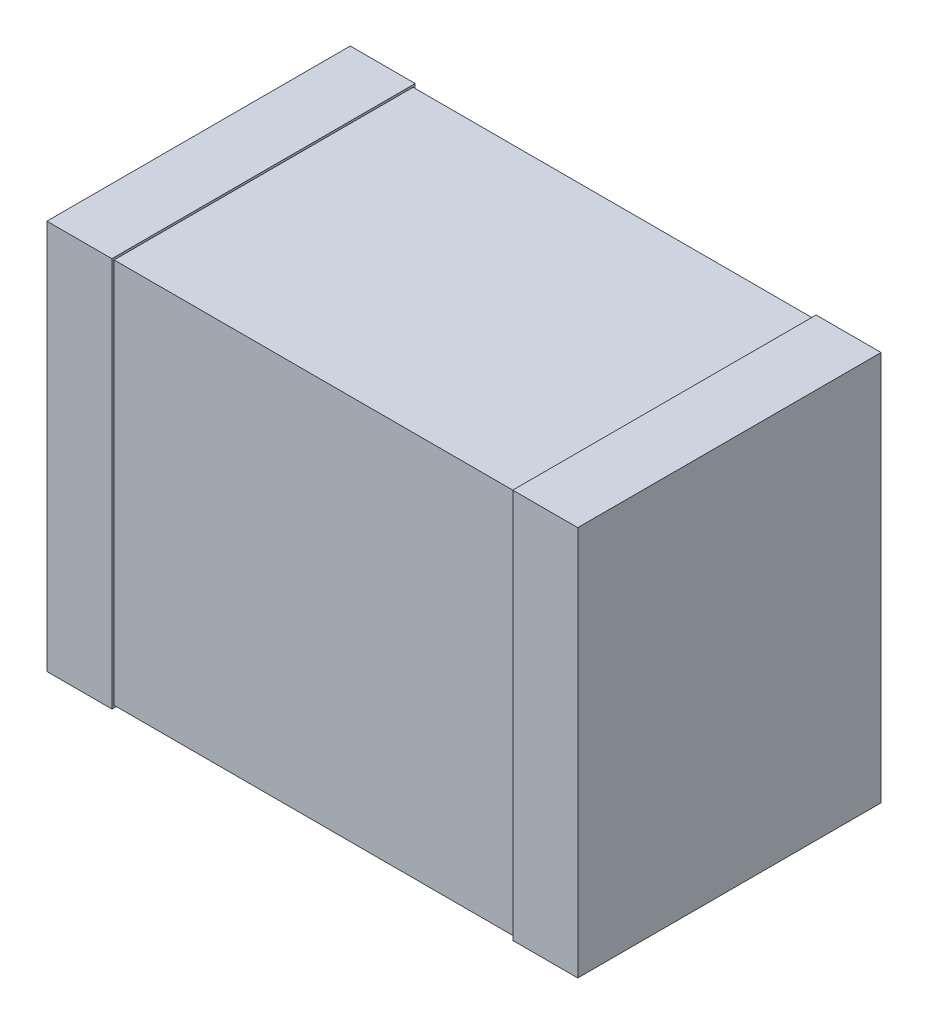
ISO-10303-21;
HEADER;
FILE_DESCRIPTION(('STEP AP214'),'2;1');
FILE_NAME('part.step','',(''),(''),'','','');
FILE_SCHEMA(('AUTOMOTIVE_DESIGN { 1 0 10303 214 1 1 1 1 }'));
ENDSEC;
DATA;
#1=APPLICATION_CONTEXT('core data for automotive mechanical design processes');
#2=APPLICATION_PROTOCOL_DEFINITION('international standard','automotive_design',2000,#1);
#3=PRODUCT_CONTEXT('',#1,'mechanical');
#4=PRODUCT('Part','Part','',(#3));
#5=PRODUCT_RELATED_PRODUCT_CATEGORY('part','',(#4));
#6=PRODUCT_DEFINITION_FORMATION('','',#4);
#7=PRODUCT_DEFINITION_CONTEXT('part definition',#1,'design');
#8=PRODUCT_DEFINITION('design','',#6,#7);
#9=PRODUCT_DEFINITION_SHAPE('','',#8);
#10=(LENGTH_UNIT() NAMED_UNIT(*) SI_UNIT(.MILLI.,.METRE.));
#11=(NAMED_UNIT(*) PLANE_ANGLE_UNIT() SI_UNIT($,.RADIAN.));
#12=(NAMED_UNIT(*) SI_UNIT($,.STERADIAN.) SOLID_ANGLE_UNIT());
#13=UNCERTAINTY_MEASURE_WITH_UNIT(LENGTH_MEASURE(1.E-05),#10,'distance_accuracy_value','');
#14=(GEOMETRIC_REPRESENTATION_CONTEXT(3) GLOBAL_UNCERTAINTY_ASSIGNED_CONTEXT((#13)) GLOBAL_UNIT_ASSIGNED_CONTEXT((#10,
#11,#12)) REPRESENTATION_CONTEXT('',''));
#15=CARTESIAN_POINT('',(0.,0.,0.));
#16=DIRECTION('',(0.,0.,1.));
#17=DIRECTION('',(1.,0.,0.));
#18=AXIS2_PLACEMENT_3D('',#15,#16,#17);
#19=CARTESIAN_POINT('',(-2.449999999897,1.8,291599.7089351));
#20=DIRECTION('',(-1.,0.,0.));
#21=DIRECTION('',(0.,0.,1.));
#22=AXIS2_PLACEMENT_3D('',#19,#20,#21);
#23=PLANE('',#22);
#24=DIRECTION('',(0.,0.,-1.));
#25=VECTOR('',#24,1.);
#26=CARTESIAN_POINT('',(-2.45000000001,1.8,1.081397970488E-11));
#27=LINE('',#26,#25);
#28=CARTESIAN_POINT('',(-2.4500000000044,1.8,2.79999999997907));
#29=VERTEX_POINT('',#28);
#30=CARTESIAN_POINT('',(-2.45000000000447,1.8,8.11048477869001E-12));
#31=VERTEX_POINT('',#30);
#32=EDGE_CURVE('E116',#29,#31,#27,.T.);
#33=ORIENTED_EDGE('',*,*,#32,.T.);
#34=DIRECTION('',(0.,1.,0.));
#35=VECTOR('',#34,1.);
#36=CARTESIAN_POINT('',(-2.45000000001028,1.8,1.081397970494E-11));
#37=LINE('',#36,#35);
#38=CARTESIAN_POINT('',(-2.4500000000044,-1.8,8.110484778675E-12));
#39=VERTEX_POINT('',#38);
#40=EDGE_CURVE('E103',#39,#31,#37,.T.);
#41=ORIENTED_EDGE('',*,*,#40,.F.);
#42=DIRECTION('',(0.,0.,-1.));
#43=VECTOR('',#42,1.);
#44=CARTESIAN_POINT('',(-2.45000000001,-1.8,1.081397970488E-11));
#45=LINE('',#44,#43);
#46=CARTESIAN_POINT('',(-2.4500000000044,-1.8,2.79999999997907));
#47=VERTEX_POINT('',#46);
#48=EDGE_CURVE('E20',#47,#39,#45,.T.);
#49=ORIENTED_EDGE('',*,*,#48,.F.);
#50=DIRECTION('',(0.,1.,0.));
#51=VECTOR('',#50,1.);
#52=CARTESIAN_POINT('',(-2.45000000001028,1.8,2.799999999979));
#53=LINE('',#52,#51);
#54=EDGE_CURVE('E131',#29,#47,#53,.F.);
#55=ORIENTED_EDGE('',*,*,#54,.F.);
#56=EDGE_LOOP('',(#33,#41,#49,#55));
#57=FACE_BOUND('',#56,.T.);
#58=ADVANCED_FACE('F17',(#57),#23,.T.);
#59=CARTESIAN_POINT('',(2.45000000001,1.8,291599.7089351));
#60=DIRECTION('',(1.,0.,0.));
#61=DIRECTION('',(0.,0.,-1.));
#62=AXIS2_PLACEMENT_3D('',#59,#60,#61);
#63=PLANE('',#62);
#64=DIRECTION('',(0.,0.,-1.));
#65=VECTOR('',#64,1.);
#66=CARTESIAN_POINT('',(2.45000000001,1.8,2.799999999979));
#67=LINE('',#66,#65);
#68=CARTESIAN_POINT('',(2.45000000001007,1.8,3.6787792864193E-12));
#69=VERTEX_POINT('',#68);
#70=CARTESIAN_POINT('',(2.45000000001014,1.8,2.79999999997907));
#71=VERTEX_POINT('',#70);
#72=EDGE_CURVE('E142',#69,#71,#67,.F.);
#73=ORIENTED_EDGE('',*,*,#72,.T.);
#74=DIRECTION('',(0.,1.,0.));
#75=VECTOR('',#74,1.);
#76=CARTESIAN_POINT('',(2.45000000001028,1.8,2.799999999979));
#77=LINE('',#76,#75);
#78=CARTESIAN_POINT('',(2.45000000001007,-1.8,2.79999999997907));
#79=VERTEX_POINT('',#78);
#80=EDGE_CURVE('E138',#79,#71,#77,.T.);
#81=ORIENTED_EDGE('',*,*,#80,.F.);
#82=DIRECTION('',(0.,0.,-1.));
#83=VECTOR('',#82,1.);
#84=CARTESIAN_POINT('',(2.45000000001,-1.8,2.799999999979));
#85=LINE('',#84,#83);
#86=CARTESIAN_POINT('',(2.45000000001007,-1.8,3.6787792864193E-12));
#87=VERTEX_POINT('',#86);
#88=EDGE_CURVE('E133',#87,#79,#85,.F.);
#89=ORIENTED_EDGE('',*,*,#88,.F.);
#90=DIRECTION('',(0.,1.,0.));
#91=VECTOR('',#90,1.);
#92=CARTESIAN_POINT('',(2.45000000001028,1.8,4.90525588902837E-12));
#93=LINE('',#92,#91);
#94=EDGE_CURVE('E151',#69,#87,#93,.F.);
#95=ORIENTED_EDGE('',*,*,#94,.F.);
#96=EDGE_LOOP('',(#73,#81,#89,#95));
#97=FACE_BOUND('',#96,.T.);
#98=ADVANCED_FACE('F272',(#97),#63,.T.);
#99=CARTESIAN_POINT('',(-2.45000000001,-1.8,1.081397970488E-11));
#100=DIRECTION('',(0.,-1.,0.));
#101=DIRECTION('',(0.,0.,-1.));
#102=AXIS2_PLACEMENT_3D('',#99,#100,#101);
#103=PLANE('',#102);
#104=DIRECTION('',(0.,0.,-1.));
#105=VECTOR('',#104,1.);
#106=CARTESIAN_POINT('',(-1.849999999877,-1.8,291599.7089351));
#107=LINE('',#106,#105);
#108=CARTESIAN_POINT('',(-1.84999999997292,-1.8,2.79999999997907));
#109=VERTEX_POINT('',#108);
#110=CARTESIAN_POINT('',(-1.84999999997292,-1.8,8.11033961905378E-12));
#111=VERTEX_POINT('',#110);
#112=EDGE_CURVE('E154',#109,#111,#107,.T.);
#113=ORIENTED_EDGE('',*,*,#112,.F.);
#114=DIRECTION('',(1.,0.,0.));
#115=VECTOR('',#114,1.);
#116=CARTESIAN_POINT('',(-400000.,-1.8,2.799999999979));
#117=LINE('',#116,#115);
#118=EDGE_CURVE('E112',#47,#109,#117,.T.);
#119=ORIENTED_EDGE('',*,*,#118,.F.);
#120=ORIENTED_EDGE('',*,*,#48,.T.);
#121=DIRECTION('',(-1.,0.,0.));
#122=VECTOR('',#121,1.);
#123=CARTESIAN_POINT('',(-400000.,-1.8,3.979039320257E-10));
#124=LINE('',#123,#122);
#125=EDGE_CURVE('E109',#111,#39,#124,.T.);
#126=ORIENTED_EDGE('',*,*,#125,.F.);
#127=EDGE_LOOP('',(#113,#119,#120,#126));
#128=FACE_BOUND('',#127,.T.);
#129=ADVANCED_FACE('F108',(#128),#103,.T.);
#130=CARTESIAN_POINT('',(-400000.,1.8,3.979039320257E-10));
#131=DIRECTION('',(0.,0.,-1.));
#132=DIRECTION('',(-1.,0.,0.));
#133=AXIS2_PLACEMENT_3D('',#130,#131,#132);
#134=PLANE('',#133);
#135=DIRECTION('',(1.,0.,0.));
#136=VECTOR('',#135,1.);
#137=CARTESIAN_POINT('',(-2.45000000001,1.8,1.081397970488E-11));
#138=LINE('',#137,#136);
#139=CARTESIAN_POINT('',(-1.84999999997876,1.8,8.11019445944756E-12));
#140=VERTEX_POINT('',#139);
#141=EDGE_CURVE('E118',#31,#140,#138,.T.);
#142=ORIENTED_EDGE('',*,*,#141,.T.);
#143=DIRECTION('',(0.,1.,0.));
#144=VECTOR('',#143,1.);
#145=CARTESIAN_POINT('',(-1.84999999996733,1.8,0.));
#146=LINE('',#145,#144);
#147=EDGE_CURVE('E122',#111,#140,#146,.T.);
#148=ORIENTED_EDGE('',*,*,#147,.F.);
#149=ORIENTED_EDGE('',*,*,#125,.T.);
#150=ORIENTED_EDGE('',*,*,#40,.T.);
#151=EDGE_LOOP('',(#142,#148,#149,#150));
#152=FACE_BOUND('',#151,.T.);
#153=ADVANCED_FACE('F120',(#152),#134,.T.);
#154=CARTESIAN_POINT('',(-2.45000000001,1.8,1.081397970488E-11));
#155=DIRECTION('',(0.,-1.,0.));
#156=DIRECTION('',(0.,0.,-1.));
#157=AXIS2_PLACEMENT_3D('',#154,#155,#156);
#158=PLANE('',#157);
#159=DIRECTION('',(1.,0.,0.));
#160=VECTOR('',#159,1.);
#161=CARTESIAN_POINT('',(-400000.,1.8,2.799999999979));
#162=LINE('',#161,#160);
#163=CARTESIAN_POINT('',(-1.84999999997292,1.8,2.79999999997907));
#164=VERTEX_POINT('',#163);
#165=EDGE_CURVE('E128',#164,#29,#162,.F.);
#166=ORIENTED_EDGE('',*,*,#165,.F.);
#167=DIRECTION('',(0.,0.,-1.));
#168=VECTOR('',#167,1.);
#169=CARTESIAN_POINT('',(-1.849999999877,1.8,291599.7089351));
#170=LINE('',#169,#168);
#171=EDGE_CURVE('E157',#140,#164,#170,.F.);
#172=ORIENTED_EDGE('',*,*,#171,.F.);
#173=ORIENTED_EDGE('',*,*,#141,.F.);
#174=ORIENTED_EDGE('',*,*,#32,.F.);
#175=EDGE_LOOP('',(#166,#172,#173,#174));
#176=FACE_BOUND('',#175,.T.);
#177=ADVANCED_FACE('F224',(#176),#158,.F.);
#178=CARTESIAN_POINT('',(-400000.,1.8,2.799999999979));
#179=DIRECTION('',(0.,0.,1.));
#180=DIRECTION('',(1.,0.,0.));
#181=AXIS2_PLACEMENT_3D('',#178,#179,#180);
#182=PLANE('',#181);
#183=ORIENTED_EDGE('',*,*,#165,.T.);
#184=ORIENTED_EDGE('',*,*,#54,.T.);
#185=ORIENTED_EDGE('',*,*,#118,.T.);
#186=DIRECTION('',(0.,1.,0.));
#187=VECTOR('',#186,1.);
#188=CARTESIAN_POINT('',(-1.84999999996733,1.8,2.79999999997926));
#189=LINE('',#188,#187);
#190=EDGE_CURVE('E160',#164,#109,#189,.F.);
#191=ORIENTED_EDGE('',*,*,#190,.F.);
#192=EDGE_LOOP('',(#183,#184,#185,#191));
#193=FACE_BOUND('',#192,.T.);
#194=ADVANCED_FACE('F226',(#193),#182,.T.);
#195=CARTESIAN_POINT('',(2.45000000001,-1.8,2.799999999979));
#196=DIRECTION('',(0.,-1.,0.));
#197=DIRECTION('',(0.,0.,-1.));
#198=AXIS2_PLACEMENT_3D('',#195,#196,#197);
#199=PLANE('',#198);
#200=DIRECTION('',(0.,0.,1.));
#201=VECTOR('',#200,1.);
#202=CARTESIAN_POINT('',(1.84999999999,-1.8,291599.7089351));
#203=LINE('',#202,#201);
#204=CARTESIAN_POINT('',(1.84999999999009,-1.8,3.67867086620206E-12));
#205=VERTEX_POINT('',#204);
#206=CARTESIAN_POINT('',(1.84999999999009,-1.8,2.79999999997907));
#207=VERTEX_POINT('',#206);
#208=EDGE_CURVE('E170',#205,#207,#203,.T.);
#209=ORIENTED_EDGE('',*,*,#208,.F.);
#210=DIRECTION('',(-1.,0.,0.));
#211=VECTOR('',#210,1.);
#212=CARTESIAN_POINT('',(-400000.,-1.8,-2.84217094304E-10));
#213=LINE('',#212,#211);
#214=EDGE_CURVE('E145',#87,#205,#213,.T.);
#215=ORIENTED_EDGE('',*,*,#214,.F.);
#216=ORIENTED_EDGE('',*,*,#88,.T.);
#217=DIRECTION('',(1.,0.,0.));
#218=VECTOR('',#217,1.);
#219=CARTESIAN_POINT('',(-400000.,-1.8,2.799999999979));
#220=LINE('',#219,#218);
#221=EDGE_CURVE('E135',#207,#79,#220,.T.);
#222=ORIENTED_EDGE('',*,*,#221,.F.);
#223=EDGE_LOOP('',(#209,#215,#216,#222));
#224=FACE_BOUND('',#223,.T.);
#225=ADVANCED_FACE('F228',(#224),#199,.T.);
#226=CARTESIAN_POINT('',(-400000.,1.8,2.799999999979));
#227=DIRECTION('',(0.,0.,1.));
#228=DIRECTION('',(1.,0.,0.));
#229=AXIS2_PLACEMENT_3D('',#226,#227,#228);
#230=PLANE('',#229);
#231=DIRECTION('',(1.,0.,0.));
#232=VECTOR('',#231,1.);
#233=CARTESIAN_POINT('',(2.45000000001,1.8,2.799999999979));
#234=LINE('',#233,#232);
#235=CARTESIAN_POINT('',(1.84999999999018,1.8,2.79999999997907));
#236=VERTEX_POINT('',#235);
#237=EDGE_CURVE('E140',#71,#236,#234,.F.);
#238=ORIENTED_EDGE('',*,*,#237,.T.);
#239=DIRECTION('',(0.,1.,0.));
#240=VECTOR('',#239,1.);
#241=CARTESIAN_POINT('',(1.84999999999,1.8,2.79999999997926));
#242=LINE('',#241,#240);
#243=EDGE_CURVE('E173',#207,#236,#242,.T.);
#244=ORIENTED_EDGE('',*,*,#243,.F.);
#245=ORIENTED_EDGE('',*,*,#221,.T.);
#246=ORIENTED_EDGE('',*,*,#80,.T.);
#247=EDGE_LOOP('',(#238,#244,#245,#246));
#248=FACE_BOUND('',#247,.T.);
#249=ADVANCED_FACE('F235',(#248),#230,.T.);
#250=CARTESIAN_POINT('',(2.45000000001,1.8,2.799999999979));
#251=DIRECTION('',(0.,-1.,0.));
#252=DIRECTION('',(0.,0.,-1.));
#253=AXIS2_PLACEMENT_3D('',#250,#251,#252);
#254=PLANE('',#253);
#255=DIRECTION('',(-1.,0.,0.));
#256=VECTOR('',#255,1.);
#257=CARTESIAN_POINT('',(-400000.,1.8,-2.84217094304E-10));
#258=LINE('',#257,#256);
#259=CARTESIAN_POINT('',(1.84999999999009,1.8,3.67867086620206E-12));
#260=VERTEX_POINT('',#259);
#261=EDGE_CURVE('E148',#260,#69,#258,.F.);
#262=ORIENTED_EDGE('',*,*,#261,.F.);
#263=DIRECTION('',(0.,0.,1.));
#264=VECTOR('',#263,1.);
#265=CARTESIAN_POINT('',(1.84999999999,1.8,291599.7089351));
#266=LINE('',#265,#264);
#267=EDGE_CURVE('E176',#236,#260,#266,.F.);
#268=ORIENTED_EDGE('',*,*,#267,.F.);
#269=ORIENTED_EDGE('',*,*,#237,.F.);
#270=ORIENTED_EDGE('',*,*,#72,.F.);
#271=EDGE_LOOP('',(#262,#268,#269,#270));
#272=FACE_BOUND('',#271,.T.);
#273=ADVANCED_FACE('F255',(#272),#254,.F.);
#274=CARTESIAN_POINT('',(-400000.,1.8,-2.84217094304E-10));
#275=DIRECTION('',(0.,0.,-1.));
#276=DIRECTION('',(-1.,0.,0.));
#277=AXIS2_PLACEMENT_3D('',#274,#275,#276);
#278=PLANE('',#277);
#279=ORIENTED_EDGE('',*,*,#261,.T.);
#280=ORIENTED_EDGE('',*,*,#94,.T.);
#281=ORIENTED_EDGE('',*,*,#214,.T.);
#282=DIRECTION('',(0.,1.,0.));
#283=VECTOR('',#282,1.);
#284=CARTESIAN_POINT('',(1.84999999999,1.8,0.));
#285=LINE('',#284,#283);
#286=EDGE_CURVE('E179',#260,#205,#285,.F.);
#287=ORIENTED_EDGE('',*,*,#286,.F.);
#288=EDGE_LOOP('',(#279,#280,#281,#287));
#289=FACE_BOUND('',#288,.T.);
#290=ADVANCED_FACE('F252',(#289),#278,.T.);
#291=CARTESIAN_POINT('',(-400000.,1.78,0.02000000000635));
#292=DIRECTION('',(0.,0.,-1.));
#293=DIRECTION('',(-1.,0.,0.));
#294=AXIS2_PLACEMENT_3D('',#291,#292,#293);
#295=PLANE('',#294);
#296=DIRECTION('',(0.,1.,0.));
#297=VECTOR('',#296,1.);
#298=CARTESIAN_POINT('',(1.84999999999,1.8,0.0200000000063483));
#299=LINE('',#298,#297);
#300=CARTESIAN_POINT('',(1.84999999999009,-1.78,0.0200000000063496));
#301=VERTEX_POINT('',#300);
#302=CARTESIAN_POINT('',(1.84999999999009,1.78,0.0200000000063491));
#303=VERTEX_POINT('',#302);
#304=EDGE_CURVE('E185',#301,#303,#299,.T.);
#305=ORIENTED_EDGE('',*,*,#304,.F.);
#306=DIRECTION('',(1.,0.,0.));
#307=VECTOR('',#306,1.);
#308=CARTESIAN_POINT('',(-2.400000000023,-1.78,0.02000000000635));
#309=LINE('',#308,#307);
#310=CARTESIAN_POINT('',(-1.849999999973,-1.78,0.0200000000063491));
#311=VERTEX_POINT('',#310);
#312=EDGE_CURVE('E168',#311,#301,#309,.T.);
#313=ORIENTED_EDGE('',*,*,#312,.F.);
#314=DIRECTION('',(0.,1.,0.));
#315=VECTOR('',#314,1.);
#316=CARTESIAN_POINT('',(-1.84999999996733,1.8,0.0200000000063483));
#317=LINE('',#316,#315);
#318=CARTESIAN_POINT('',(-1.84999999997875,1.78,0.0200000000063491));
#319=VERTEX_POINT('',#318);
#320=EDGE_CURVE('E163',#319,#311,#317,.F.);
#321=ORIENTED_EDGE('',*,*,#320,.F.);
#322=DIRECTION('',(1.,0.,0.));
#323=VECTOR('',#322,1.);
#324=CARTESIAN_POINT('',(-2.400000000023,1.78,0.02000000000635));
#325=LINE('',#324,#323);
#326=EDGE_CURVE('E191',#319,#303,#325,.T.);
#327=ORIENTED_EDGE('',*,*,#326,.T.);
#328=EDGE_LOOP('',(#305,#313,#321,#327));
#329=FACE_BOUND('',#328,.T.);
#330=ADVANCED_FACE('F211',(#329),#295,.T.);
#331=CARTESIAN_POINT('',(-1.849999999877,1.8,291599.7089351));
#332=DIRECTION('',(1.,0.,0.));
#333=DIRECTION('',(0.,0.,-1.));
#334=AXIS2_PLACEMENT_3D('',#331,#332,#333);
#335=PLANE('',#334);
#336=DIRECTION('',(0.,0.,-1.));
#337=VECTOR('',#336,1.);
#338=CARTESIAN_POINT('',(-1.849999999967,-1.78,2.779999999973));
#339=LINE('',#338,#337);
#340=CARTESIAN_POINT('',(-1.849999999973,-1.78,2.77999999997296));
#341=VERTEX_POINT('',#340);
#342=EDGE_CURVE('E165',#341,#311,#339,.T.);
#343=ORIENTED_EDGE('',*,*,#342,.F.);
#344=DIRECTION('',(0.,1.,0.));
#345=VECTOR('',#344,1.);
#346=CARTESIAN_POINT('',(-1.84999999999036,1.78,2.779999999973));
#347=LINE('',#346,#345);
#348=CARTESIAN_POINT('',(-1.84999999997875,1.78,2.77999999997296));
#349=VERTEX_POINT('',#348);
#350=EDGE_CURVE('E194',#349,#341,#347,.F.);
#351=ORIENTED_EDGE('',*,*,#350,.F.);
#352=DIRECTION('',(0.,0.,-1.));
#353=VECTOR('',#352,1.);
#354=CARTESIAN_POINT('',(-1.84999999999,1.78,2.779999999973));
#355=LINE('',#354,#353);
#356=EDGE_CURVE('E188',#349,#319,#355,.T.);
#357=ORIENTED_EDGE('',*,*,#356,.T.);
#358=ORIENTED_EDGE('',*,*,#320,.T.);
#359=EDGE_LOOP('',(#343,#351,#357,#358));
#360=FACE_BOUND('',#359,.T.);
#361=ORIENTED_EDGE('',*,*,#171,.T.);
#362=ORIENTED_EDGE('',*,*,#190,.T.);
#363=ORIENTED_EDGE('',*,*,#112,.T.);
#364=ORIENTED_EDGE('',*,*,#147,.T.);
#365=EDGE_LOOP('',(#361,#362,#363,#364));
#366=FACE_BOUND('',#365,.T.);
#367=ADVANCED_FACE('F217',(#360,#366),#335,.T.);
#368=CARTESIAN_POINT('',(-2.400000000023,-1.78,2.779999999973));
#369=DIRECTION('',(0.,-1.,0.));
#370=DIRECTION('',(0.,0.,-1.));
#371=AXIS2_PLACEMENT_3D('',#368,#369,#370);
#372=PLANE('',#371);
#373=DIRECTION('',(0.,0.,1.));
#374=VECTOR('',#373,1.);
#375=CARTESIAN_POINT('',(1.84999999999,-1.78,291599.7089351));
#376=LINE('',#375,#374);
#377=CARTESIAN_POINT('',(1.84999999999009,-1.78,2.77999999997298));
#378=VERTEX_POINT('',#377);
#379=EDGE_CURVE('E182',#378,#301,#376,.F.);
#380=ORIENTED_EDGE('',*,*,#379,.F.);
#381=DIRECTION('',(1.,0.,0.));
#382=VECTOR('',#381,1.);
#383=CARTESIAN_POINT('',(-400000.,-1.78,2.779999999973));
#384=LINE('',#383,#382);
#385=EDGE_CURVE('E197',#341,#378,#384,.T.);
#386=ORIENTED_EDGE('',*,*,#385,.F.);
#387=ORIENTED_EDGE('',*,*,#342,.T.);
#388=ORIENTED_EDGE('',*,*,#312,.T.);
#389=EDGE_LOOP('',(#380,#386,#387,#388));
#390=FACE_BOUND('',#389,.T.);
#391=ADVANCED_FACE('F208',(#390),#372,.T.);
#392=CARTESIAN_POINT('',(1.84999999999,1.8,291599.7089351));
#393=DIRECTION('',(-1.,0.,0.));
#394=DIRECTION('',(0.,0.,1.));
#395=AXIS2_PLACEMENT_3D('',#392,#393,#394);
#396=PLANE('',#395);
#397=ORIENTED_EDGE('',*,*,#379,.T.);
#398=ORIENTED_EDGE('',*,*,#304,.T.);
#399=DIRECTION('',(0.,0.,-1.));
#400=VECTOR('',#399,1.);
#401=CARTESIAN_POINT('',(1.84999999999,1.78,2.779999999973));
#402=LINE('',#401,#400);
#403=CARTESIAN_POINT('',(1.84999999999009,1.78,2.77999999997296));
#404=VERTEX_POINT('',#403);
#405=EDGE_CURVE('E35',#303,#404,#402,.F.);
#406=ORIENTED_EDGE('',*,*,#405,.T.);
#407=DIRECTION('',(0.,1.,0.));
#408=VECTOR('',#407,1.);
#409=CARTESIAN_POINT('',(1.84999999999036,1.78,2.779999999973));
#410=LINE('',#409,#408);
#411=EDGE_CURVE('E26',#378,#404,#410,.T.);
#412=ORIENTED_EDGE('',*,*,#411,.F.);
#413=EDGE_LOOP('',(#397,#398,#406,#412));
#414=FACE_BOUND('',#413,.T.);
#415=ORIENTED_EDGE('',*,*,#267,.T.);
#416=ORIENTED_EDGE('',*,*,#286,.T.);
#417=ORIENTED_EDGE('',*,*,#208,.T.);
#418=ORIENTED_EDGE('',*,*,#243,.T.);
#419=EDGE_LOOP('',(#415,#416,#417,#418));
#420=FACE_BOUND('',#419,.T.);
#421=ADVANCED_FACE('F204',(#414,#420),#396,.T.);
#422=CARTESIAN_POINT('',(-2.400000000023,1.78,2.779999999973));
#423=DIRECTION('',(0.,-1.,0.));
#424=DIRECTION('',(0.,0.,-1.));
#425=AXIS2_PLACEMENT_3D('',#422,#423,#424);
#426=PLANE('',#425);
#427=ORIENTED_EDGE('',*,*,#356,.F.);
#428=DIRECTION('',(1.,0.,0.));
#429=VECTOR('',#428,1.);
#430=CARTESIAN_POINT('',(-400000.,1.78,2.779999999973));
#431=LINE('',#430,#429);
#432=EDGE_CURVE('E11',#404,#349,#431,.F.);
#433=ORIENTED_EDGE('',*,*,#432,.F.);
#434=ORIENTED_EDGE('',*,*,#405,.F.);
#435=ORIENTED_EDGE('',*,*,#326,.F.);
#436=EDGE_LOOP('',(#427,#433,#434,#435));
#437=FACE_BOUND('',#436,.T.);
#438=ADVANCED_FACE('F215',(#437),#426,.F.);
#439=CARTESIAN_POINT('',(-400000.,1.78,2.779999999973));
#440=DIRECTION('',(0.,0.,1.));
#441=DIRECTION('',(1.,0.,0.));
#442=AXIS2_PLACEMENT_3D('',#439,#440,#441);
#443=PLANE('',#442);
#444=ORIENTED_EDGE('',*,*,#411,.T.);
#445=ORIENTED_EDGE('',*,*,#432,.T.);
#446=ORIENTED_EDGE('',*,*,#350,.T.);
#447=ORIENTED_EDGE('',*,*,#385,.T.);
#448=EDGE_LOOP('',(#444,#445,#446,#447));
#449=FACE_BOUND('',#448,.T.);
#450=ADVANCED_FACE('F202',(#449),#443,.T.);
#451=CLOSED_SHELL('',(#58,#98,#129,#153,#177,#194,#225,#249,#273,#290,#330,#367,#391,#421,#438,#450));
#452=MANIFOLD_SOLID_BREP('B1',#451);
#453=ADVANCED_BREP_SHAPE_REPRESENTATION('',(#18,#452),#14);
#454=SHAPE_DEFINITION_REPRESENTATION(#9,#453);
ENDSEC;
END-ISO-10303-21;
